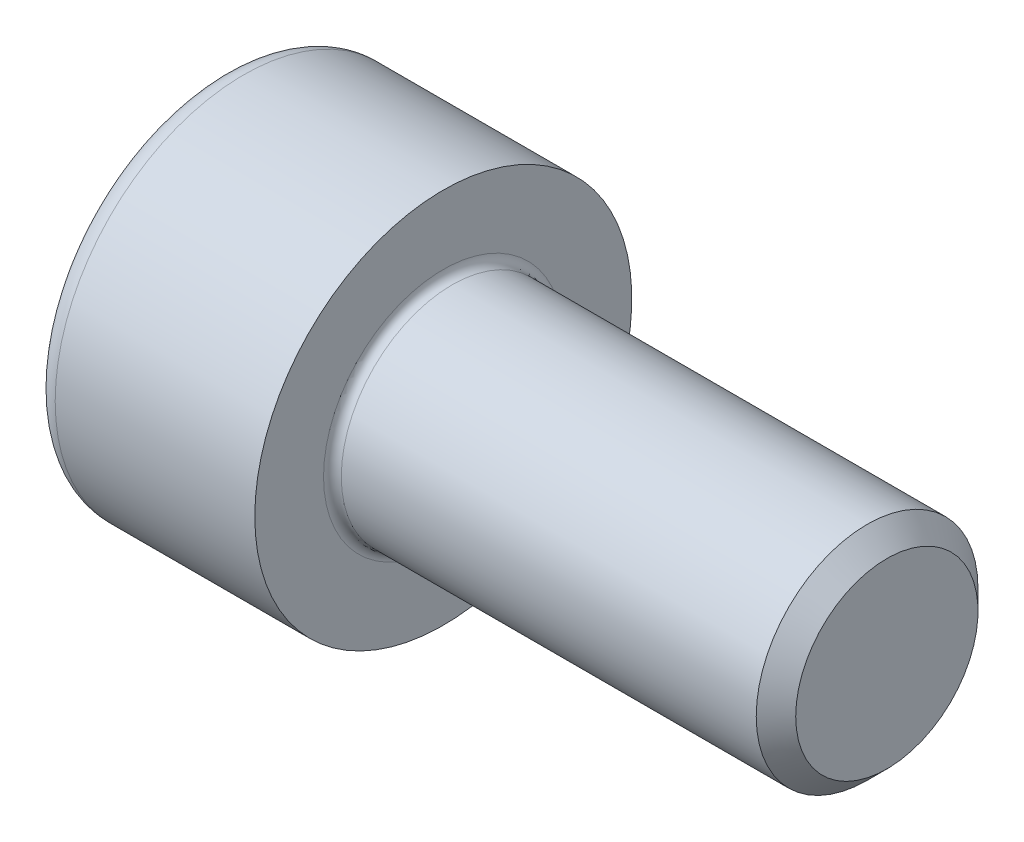
ISO-10303-21;
HEADER;
FILE_DESCRIPTION(('STEP AP214'),'2;1');
FILE_NAME('part.step','',(''),(''),'','','');
FILE_SCHEMA(('AUTOMOTIVE_DESIGN { 1 0 10303 214 1 1 1 1 }'));
ENDSEC;
DATA;
#1=APPLICATION_CONTEXT('core data for automotive mechanical design processes');
#2=APPLICATION_PROTOCOL_DEFINITION('international standard','automotive_design',2000,#1);
#3=PRODUCT_CONTEXT('',#1,'mechanical');
#4=PRODUCT('Part','Part','',(#3));
#5=PRODUCT_RELATED_PRODUCT_CATEGORY('part','',(#4));
#6=PRODUCT_DEFINITION_FORMATION('','',#4);
#7=PRODUCT_DEFINITION_CONTEXT('part definition',#1,'design');
#8=PRODUCT_DEFINITION('design','',#6,#7);
#9=PRODUCT_DEFINITION_SHAPE('','',#8);
#10=(LENGTH_UNIT() NAMED_UNIT(*) SI_UNIT(.MILLI.,.METRE.));
#11=(NAMED_UNIT(*) PLANE_ANGLE_UNIT() SI_UNIT($,.RADIAN.));
#12=(NAMED_UNIT(*) SI_UNIT($,.STERADIAN.) SOLID_ANGLE_UNIT());
#13=UNCERTAINTY_MEASURE_WITH_UNIT(LENGTH_MEASURE(1.E-05),#10,'distance_accuracy_value','');
#14=(GEOMETRIC_REPRESENTATION_CONTEXT(3) GLOBAL_UNCERTAINTY_ASSIGNED_CONTEXT((#13)) GLOBAL_UNIT_ASSIGNED_CONTEXT((#10,
#11,#12)) REPRESENTATION_CONTEXT('',''));
#15=CARTESIAN_POINT('',(0.,0.,0.));
#16=DIRECTION('',(0.,0.,1.));
#17=DIRECTION('',(1.,0.,0.));
#18=AXIS2_PLACEMENT_3D('',#15,#16,#17);
#19=CARTESIAN_POINT('',(0.,0.,0.));
#20=DIRECTION('',(-1.,0.,0.));
#21=DIRECTION('',(0.,0.,1.));
#22=AXIS2_PLACEMENT_3D('',#19,#20,#21);
#23=PLANE('',#22);
#24=DIRECTION('',(0.,-0.499999999999998,0.86602540378444));
#25=VECTOR('',#24,1.);
#26=CARTESIAN_POINT('',(0.,2.3209480821423,0.));
#27=LINE('',#26,#25);
#28=CARTESIAN_POINT('',(0.,2.3209480821423,0.));
#29=VERTEX_POINT('',#28);
#30=CARTESIAN_POINT('',(0.,1.16047404107115,2.01));
#31=VERTEX_POINT('',#30);
#32=EDGE_CURVE('E300',#29,#31,#27,.T.);
#33=ORIENTED_EDGE('',*,*,#32,.T.);
#34=DIRECTION('',(0.,1.,0.));
#35=VECTOR('',#34,1.);
#36=CARTESIAN_POINT('',(0.,-1.16047404107114,2.01));
#37=LINE('',#36,#35);
#38=CARTESIAN_POINT('',(0.,-1.16047404107114,2.01));
#39=VERTEX_POINT('',#38);
#40=EDGE_CURVE('E144',#39,#31,#37,.T.);
#41=ORIENTED_EDGE('',*,*,#40,.F.);
#42=DIRECTION('',(0.,-0.500000000000001,-0.866025403784438));
#43=VECTOR('',#42,1.);
#44=CARTESIAN_POINT('',(0.,-1.16047404107114,2.01));
#45=LINE('',#44,#43);
#46=CARTESIAN_POINT('',(0.,-2.3209480821423,0.));
#47=VERTEX_POINT('',#46);
#48=EDGE_CURVE('E305',#39,#47,#45,.T.);
#49=ORIENTED_EDGE('',*,*,#48,.T.);
#50=DIRECTION('',(0.,0.499999999999999,-0.86602540378444));
#51=VECTOR('',#50,1.);
#52=CARTESIAN_POINT('',(0.,-2.3209480821423,0.));
#53=LINE('',#52,#51);
#54=CARTESIAN_POINT('',(0.,-1.16047404107115,-2.01));
#55=VERTEX_POINT('',#54);
#56=EDGE_CURVE('E309',#47,#55,#53,.T.);
#57=ORIENTED_EDGE('',*,*,#56,.T.);
#58=DIRECTION('',(0.,-1.,0.));
#59=VECTOR('',#58,1.);
#60=CARTESIAN_POINT('',(0.,1.16047404107115,-2.01));
#61=LINE('',#60,#59);
#62=CARTESIAN_POINT('',(0.,1.16047404107115,-2.01));
#63=VERTEX_POINT('',#62);
#64=EDGE_CURVE('E313',#63,#55,#61,.T.);
#65=ORIENTED_EDGE('',*,*,#64,.F.);
#66=DIRECTION('',(0.,-0.500000000000001,-0.866025403784438));
#67=VECTOR('',#66,1.);
#68=CARTESIAN_POINT('',(0.,2.3209480821423,0.));
#69=LINE('',#68,#67);
#70=EDGE_CURVE('E139',#29,#63,#69,.T.);
#71=ORIENTED_EDGE('',*,*,#70,.F.);
#72=EDGE_LOOP('',(#33,#41,#49,#57,#65,#71));
#73=FACE_BOUND('',#72,.T.);
#74=CARTESIAN_POINT('',(0.,0.,0.));
#75=DIRECTION('',(-1.,0.,0.));
#76=DIRECTION('',(0.,0.,1.));
#77=AXIS2_PLACEMENT_3D('',#74,#75,#76);
#78=CIRCLE('',#77,3.75);
#79=CARTESIAN_POINT('',(0.,0.,3.75));
#80=VERTEX_POINT('',#79);
#81=EDGE_CURVE('E58',#80,#80,#78,.T.);
#82=ORIENTED_EDGE('',*,*,#81,.T.);
#83=EDGE_LOOP('',(#82));
#84=FACE_BOUND('',#83,.T.);
#85=ADVANCED_FACE('F49',(#73,#84),#23,.T.);
#86=CARTESIAN_POINT('',(-31.75,0.,0.));
#87=DIRECTION('',(-1.,0.,0.));
#88=DIRECTION('',(0.,0.,1.));
#89=AXIS2_PLACEMENT_3D('',#86,#87,#88);
#90=CYLINDRICAL_SURFACE('',#89,4.25);
#91=CARTESIAN_POINT('',(0.5,0.,0.));
#92=DIRECTION('',(-1.,0.,0.));
#93=DIRECTION('',(0.,0.,1.));
#94=AXIS2_PLACEMENT_3D('',#91,#92,#93);
#95=CIRCLE('',#94,4.25);
#96=CARTESIAN_POINT('',(0.5,0.,4.25));
#97=VERTEX_POINT('',#96);
#98=EDGE_CURVE('E11',#97,#97,#95,.F.);
#99=ORIENTED_EDGE('',*,*,#98,.T.);
#100=EDGE_LOOP('',(#99));
#101=FACE_BOUND('',#100,.T.);
#102=CARTESIAN_POINT('',(5.,0.,0.));
#103=DIRECTION('',(-1.,0.,0.));
#104=DIRECTION('',(0.,0.,1.));
#105=AXIS2_PLACEMENT_3D('',#102,#103,#104);
#106=CIRCLE('',#105,4.25);
#107=CARTESIAN_POINT('',(5.,0.,4.25));
#108=VERTEX_POINT('',#107);
#109=EDGE_CURVE('E168',#108,#108,#106,.T.);
#110=ORIENTED_EDGE('',*,*,#109,.T.);
#111=EDGE_LOOP('',(#110));
#112=FACE_BOUND('',#111,.T.);
#113=ADVANCED_FACE('F197',(#101,#112),#90,.T.);
#114=CARTESIAN_POINT('',(5.,4.25,0.));
#115=DIRECTION('',(1.,0.,0.));
#116=DIRECTION('',(0.,0.,-1.));
#117=AXIS2_PLACEMENT_3D('',#114,#115,#116);
#118=PLANE('',#117);
#119=CARTESIAN_POINT('',(5.,0.,0.));
#120=DIRECTION('',(1.,0.,0.));
#121=DIRECTION('',(0.,0.,-1.));
#122=AXIS2_PLACEMENT_3D('',#119,#120,#121);
#123=CIRCLE('',#122,2.7);
#124=CARTESIAN_POINT('',(5.,0.,-2.7));
#125=VERTEX_POINT('',#124);
#126=EDGE_CURVE('E172',#125,#125,#123,.F.);
#127=ORIENTED_EDGE('',*,*,#126,.T.);
#128=EDGE_LOOP('',(#127));
#129=FACE_BOUND('',#128,.T.);
#130=ORIENTED_EDGE('',*,*,#109,.F.);
#131=EDGE_LOOP('',(#130));
#132=FACE_BOUND('',#131,.T.);
#133=ADVANCED_FACE('F202',(#129,#132),#118,.T.);
#134=CARTESIAN_POINT('',(-31.75,0.,0.));
#135=DIRECTION('',(-1.,0.,0.));
#136=DIRECTION('',(0.,0.,1.));
#137=AXIS2_PLACEMENT_3D('',#134,#135,#136);
#138=CYLINDRICAL_SURFACE('',#137,2.5);
#139=CARTESIAN_POINT('',(5.2,0.,0.));
#140=DIRECTION('',(1.,0.,0.));
#141=DIRECTION('',(0.,0.,-1.));
#142=AXIS2_PLACEMENT_3D('',#139,#140,#141);
#143=CIRCLE('',#142,2.5);
#144=CARTESIAN_POINT('',(5.2,0.,-2.5));
#145=VERTEX_POINT('',#144);
#146=EDGE_CURVE('E176',#145,#145,#143,.T.);
#147=ORIENTED_EDGE('',*,*,#146,.T.);
#148=EDGE_LOOP('',(#147));
#149=FACE_BOUND('',#148,.T.);
#150=CARTESIAN_POINT('',(14.555,0.,0.));
#151=DIRECTION('',(-1.,0.,0.));
#152=DIRECTION('',(0.,0.,1.));
#153=AXIS2_PLACEMENT_3D('',#150,#151,#152);
#154=CIRCLE('',#153,2.5);
#155=CARTESIAN_POINT('',(14.555,0.,2.5));
#156=VERTEX_POINT('',#155);
#157=EDGE_CURVE('E164',#156,#156,#154,.T.);
#158=ORIENTED_EDGE('',*,*,#157,.T.);
#159=EDGE_LOOP('',(#158));
#160=FACE_BOUND('',#159,.T.);
#161=ADVANCED_FACE('F208',(#149,#160),#138,.T.);
#162=CARTESIAN_POINT('',(15.,0.,0.));
#163=DIRECTION('',(-1.,0.,0.));
#164=DIRECTION('',(0.,0.,1.));
#165=AXIS2_PLACEMENT_3D('',#162,#163,#164);
#166=CONICAL_SURFACE('',#165,2.055,0.785398163397455);
#167=ORIENTED_EDGE('',*,*,#157,.F.);
#168=EDGE_LOOP('',(#167));
#169=FACE_BOUND('',#168,.T.);
#170=CARTESIAN_POINT('',(15.,0.,0.));
#171=DIRECTION('',(-1.,0.,0.));
#172=DIRECTION('',(0.,0.,1.));
#173=AXIS2_PLACEMENT_3D('',#170,#171,#172);
#174=CIRCLE('',#173,2.055);
#175=CARTESIAN_POINT('',(15.,0.,2.055));
#176=VERTEX_POINT('',#175);
#177=EDGE_CURVE('E159',#176,#176,#174,.T.);
#178=ORIENTED_EDGE('',*,*,#177,.T.);
#179=EDGE_LOOP('',(#178));
#180=FACE_BOUND('',#179,.T.);
#181=ADVANCED_FACE('F212',(#169,#180),#166,.T.);
#182=CARTESIAN_POINT('',(15.,2.055,0.));
#183=DIRECTION('',(1.,0.,0.));
#184=DIRECTION('',(0.,0.,-1.));
#185=AXIS2_PLACEMENT_3D('',#182,#183,#184);
#186=PLANE('',#185);
#187=ORIENTED_EDGE('',*,*,#177,.F.);
#188=EDGE_LOOP('',(#187));
#189=FACE_BOUND('',#188,.T.);
#190=ADVANCED_FACE('F194',(#189),#186,.T.);
#191=CARTESIAN_POINT('',(5.2,0.,0.));
#192=DIRECTION('',(1.,0.,0.));
#193=DIRECTION('',(0.,0.,-1.));
#194=AXIS2_PLACEMENT_3D('',#191,#192,#193);
#195=TOROIDAL_SURFACE('',#194,2.7,0.2);
#196=ORIENTED_EDGE('',*,*,#146,.F.);
#197=EDGE_LOOP('',(#196));
#198=FACE_BOUND('',#197,.T.);
#199=ORIENTED_EDGE('',*,*,#126,.F.);
#200=EDGE_LOOP('',(#199));
#201=FACE_BOUND('',#200,.T.);
#202=ADVANCED_FACE('F185',(#198,#201),#195,.F.);
#203=CARTESIAN_POINT('',(0.5,0.,0.));
#204=DIRECTION('',(-1.,0.,0.));
#205=DIRECTION('',(0.,0.,1.));
#206=AXIS2_PLACEMENT_3D('',#203,#204,#205);
#207=TOROIDAL_SURFACE('',#206,3.75,0.5);
#208=ORIENTED_EDGE('',*,*,#98,.F.);
#209=EDGE_LOOP('',(#208));
#210=FACE_BOUND('',#209,.T.);
#211=ORIENTED_EDGE('',*,*,#81,.F.);
#212=EDGE_LOOP('',(#211));
#213=FACE_BOUND('',#212,.T.);
#214=ADVANCED_FACE('F51',(#210,#213),#207,.T.);
#215=CARTESIAN_POINT('',(2.5,2.3209480821423,0.));
#216=DIRECTION('',(0.,-0.86602540378444,-0.499999999999998));
#217=DIRECTION('',(0.,0.499999999999998,-0.86602540378444));
#218=AXIS2_PLACEMENT_3D('',#215,#216,#217);
#219=PLANE('',#218);
#220=ORIENTED_EDGE('',*,*,#32,.F.);
#221=DIRECTION('',(-1.,0.,0.));
#222=VECTOR('',#221,1.);
#223=CARTESIAN_POINT('',(2.5,2.3209480821423,0.));
#224=LINE('',#223,#222);
#225=CARTESIAN_POINT('',(2.5,2.3209480821423,0.));
#226=VERTEX_POINT('',#225);
#227=EDGE_CURVE('E299',#226,#29,#224,.T.);
#228=ORIENTED_EDGE('',*,*,#227,.F.);
#229=DIRECTION('',(0.,-0.499999999999998,0.86602540378444));
#230=VECTOR('',#229,1.);
#231=CARTESIAN_POINT('',(2.5,2.3209480821423,0.));
#232=LINE('',#231,#230);
#233=CARTESIAN_POINT('',(2.5,1.74071106160672,1.005));
#234=VERTEX_POINT('',#233);
#235=EDGE_CURVE('E65',#226,#234,#232,.T.);
#236=ORIENTED_EDGE('',*,*,#235,.T.);
#237=CARTESIAN_POINT('',(2.5,1.16047404107115,2.01));
#238=VERTEX_POINT('',#237);
#239=EDGE_CURVE('E123',#234,#238,#232,.T.);
#240=ORIENTED_EDGE('',*,*,#239,.T.);
#241=DIRECTION('',(-1.,0.,0.));
#242=VECTOR('',#241,1.);
#243=CARTESIAN_POINT('',(2.5,1.16047404107115,2.01));
#244=LINE('',#243,#242);
#245=EDGE_CURVE('E136',#238,#31,#244,.T.);
#246=ORIENTED_EDGE('',*,*,#245,.T.);
#247=EDGE_LOOP('',(#220,#228,#236,#240,#246));
#248=FACE_BOUND('',#247,.T.);
#249=ADVANCED_FACE('F135',(#248),#219,.T.);
#250=CARTESIAN_POINT('',(2.5,-1.16047404107114,2.01));
#251=DIRECTION('',(0.,0.,1.));
#252=DIRECTION('',(0.,-1.,0.));
#253=AXIS2_PLACEMENT_3D('',#250,#251,#252);
#254=PLANE('',#253);
#255=ORIENTED_EDGE('',*,*,#40,.T.);
#256=ORIENTED_EDGE('',*,*,#245,.F.);
#257=DIRECTION('',(0.,1.,0.));
#258=VECTOR('',#257,1.);
#259=CARTESIAN_POINT('',(2.5,-1.16047404107114,2.01));
#260=LINE('',#259,#258);
#261=CARTESIAN_POINT('',(2.5,0.,2.01));
#262=VERTEX_POINT('',#261);
#263=EDGE_CURVE('E121',#262,#238,#260,.T.);
#264=ORIENTED_EDGE('',*,*,#263,.F.);
#265=CARTESIAN_POINT('',(2.5,-1.16047404107114,2.01));
#266=VERTEX_POINT('',#265);
#267=EDGE_CURVE('E132',#266,#262,#260,.T.);
#268=ORIENTED_EDGE('',*,*,#267,.F.);
#269=DIRECTION('',(-1.,0.,0.));
#270=VECTOR('',#269,1.);
#271=CARTESIAN_POINT('',(2.5,-1.16047404107114,2.01));
#272=LINE('',#271,#270);
#273=EDGE_CURVE('E147',#266,#39,#272,.T.);
#274=ORIENTED_EDGE('',*,*,#273,.T.);
#275=EDGE_LOOP('',(#255,#256,#264,#268,#274));
#276=FACE_BOUND('',#275,.T.);
#277=ADVANCED_FACE('F141',(#276),#254,.F.);
#278=CARTESIAN_POINT('',(2.5,-1.16047404107114,2.01));
#279=DIRECTION('',(0.,0.866025403784438,-0.500000000000001));
#280=DIRECTION('',(0.,0.500000000000001,0.866025403784438));
#281=AXIS2_PLACEMENT_3D('',#278,#279,#280);
#282=PLANE('',#281);
#283=ORIENTED_EDGE('',*,*,#48,.F.);
#284=ORIENTED_EDGE('',*,*,#273,.F.);
#285=DIRECTION('',(0.,-0.500000000000001,-0.866025403784438));
#286=VECTOR('',#285,1.);
#287=CARTESIAN_POINT('',(2.5,-1.16047404107114,2.01));
#288=LINE('',#287,#286);
#289=CARTESIAN_POINT('',(2.5,-1.74071106160672,1.005));
#290=VERTEX_POINT('',#289);
#291=EDGE_CURVE('E274',#266,#290,#288,.T.);
#292=ORIENTED_EDGE('',*,*,#291,.T.);
#293=CARTESIAN_POINT('',(2.5,-2.3209480821423,0.));
#294=VERTEX_POINT('',#293);
#295=EDGE_CURVE('E276',#290,#294,#288,.T.);
#296=ORIENTED_EDGE('',*,*,#295,.T.);
#297=DIRECTION('',(-1.,0.,0.));
#298=VECTOR('',#297,1.);
#299=CARTESIAN_POINT('',(2.5,-2.3209480821423,0.));
#300=LINE('',#299,#298);
#301=EDGE_CURVE('E154',#294,#47,#300,.T.);
#302=ORIENTED_EDGE('',*,*,#301,.T.);
#303=EDGE_LOOP('',(#283,#284,#292,#296,#302));
#304=FACE_BOUND('',#303,.T.);
#305=ADVANCED_FACE('F225',(#304),#282,.T.);
#306=CARTESIAN_POINT('',(2.5,-2.3209480821423,0.));
#307=DIRECTION('',(0.,0.86602540378444,0.499999999999998));
#308=DIRECTION('',(0.,-0.499999999999998,0.86602540378444));
#309=AXIS2_PLACEMENT_3D('',#306,#307,#308);
#310=PLANE('',#309);
#311=ORIENTED_EDGE('',*,*,#56,.F.);
#312=ORIENTED_EDGE('',*,*,#301,.F.);
#313=DIRECTION('',(0.,0.499999999999999,-0.86602540378444));
#314=VECTOR('',#313,1.);
#315=CARTESIAN_POINT('',(2.5,-2.3209480821423,0.));
#316=LINE('',#315,#314);
#317=CARTESIAN_POINT('',(2.5,-1.74071106160672,-1.005));
#318=VERTEX_POINT('',#317);
#319=EDGE_CURVE('E279',#294,#318,#316,.T.);
#320=ORIENTED_EDGE('',*,*,#319,.T.);
#321=CARTESIAN_POINT('',(2.5,-1.16047404107115,-2.01));
#322=VERTEX_POINT('',#321);
#323=EDGE_CURVE('E285',#318,#322,#316,.T.);
#324=ORIENTED_EDGE('',*,*,#323,.T.);
#325=DIRECTION('',(-1.,0.,0.));
#326=VECTOR('',#325,1.);
#327=CARTESIAN_POINT('',(2.5,-1.16047404107115,-2.01));
#328=LINE('',#327,#326);
#329=EDGE_CURVE('E326',#322,#55,#328,.T.);
#330=ORIENTED_EDGE('',*,*,#329,.T.);
#331=EDGE_LOOP('',(#311,#312,#320,#324,#330));
#332=FACE_BOUND('',#331,.T.);
#333=ADVANCED_FACE('F228',(#332),#310,.T.);
#334=CARTESIAN_POINT('',(2.5,1.16047404107115,-2.01));
#335=DIRECTION('',(0.,0.,-1.));
#336=DIRECTION('',(0.,1.,0.));
#337=AXIS2_PLACEMENT_3D('',#334,#335,#336);
#338=PLANE('',#337);
#339=ORIENTED_EDGE('',*,*,#64,.T.);
#340=ORIENTED_EDGE('',*,*,#329,.F.);
#341=DIRECTION('',(0.,-1.,0.));
#342=VECTOR('',#341,1.);
#343=CARTESIAN_POINT('',(2.5,1.16047404107115,-2.01));
#344=LINE('',#343,#342);
#345=CARTESIAN_POINT('',(2.5,0.,-2.01));
#346=VERTEX_POINT('',#345);
#347=EDGE_CURVE('E291',#346,#322,#344,.T.);
#348=ORIENTED_EDGE('',*,*,#347,.F.);
#349=CARTESIAN_POINT('',(2.5,1.16047404107115,-2.01));
#350=VERTEX_POINT('',#349);
#351=EDGE_CURVE('E292',#350,#346,#344,.T.);
#352=ORIENTED_EDGE('',*,*,#351,.F.);
#353=DIRECTION('',(-1.,0.,0.));
#354=VECTOR('',#353,1.);
#355=CARTESIAN_POINT('',(2.5,1.16047404107115,-2.01));
#356=LINE('',#355,#354);
#357=EDGE_CURVE('E322',#350,#63,#356,.T.);
#358=ORIENTED_EDGE('',*,*,#357,.T.);
#359=EDGE_LOOP('',(#339,#340,#348,#352,#358));
#360=FACE_BOUND('',#359,.T.);
#361=ADVANCED_FACE('F232',(#360),#338,.F.);
#362=CARTESIAN_POINT('',(2.5,2.3209480821423,0.));
#363=DIRECTION('',(0.,0.866025403784438,-0.500000000000001));
#364=DIRECTION('',(0.,0.500000000000001,0.866025403784438));
#365=AXIS2_PLACEMENT_3D('',#362,#363,#364);
#366=PLANE('',#365);
#367=ORIENTED_EDGE('',*,*,#70,.T.);
#368=ORIENTED_EDGE('',*,*,#357,.F.);
#369=DIRECTION('',(0.,-0.500000000000001,-0.866025403784438));
#370=VECTOR('',#369,1.);
#371=CARTESIAN_POINT('',(2.5,2.3209480821423,0.));
#372=LINE('',#371,#370);
#373=CARTESIAN_POINT('',(2.5,1.74071106160672,-1.005));
#374=VERTEX_POINT('',#373);
#375=EDGE_CURVE('E296',#374,#350,#372,.T.);
#376=ORIENTED_EDGE('',*,*,#375,.F.);
#377=EDGE_CURVE('E264',#226,#374,#372,.T.);
#378=ORIENTED_EDGE('',*,*,#377,.F.);
#379=ORIENTED_EDGE('',*,*,#227,.T.);
#380=EDGE_LOOP('',(#367,#368,#376,#378,#379));
#381=FACE_BOUND('',#380,.T.);
#382=ADVANCED_FACE('F236',(#381),#366,.F.);
#383=CARTESIAN_POINT('',(2.5,1.16047404107115,2.01));
#384=DIRECTION('',(-1.,0.,0.));
#385=DIRECTION('',(0.,0.,1.));
#386=AXIS2_PLACEMENT_3D('',#383,#384,#385);
#387=PLANE('',#386);
#388=CARTESIAN_POINT('',(2.5,0.,0.));
#389=DIRECTION('',(-1.,0.,0.));
#390=DIRECTION('',(0.,0.,1.));
#391=AXIS2_PLACEMENT_3D('',#388,#389,#390);
#392=CIRCLE('',#391,2.01);
#393=EDGE_CURVE('E146',#290,#262,#392,.T.);
#394=ORIENTED_EDGE('',*,*,#393,.F.);
#395=ORIENTED_EDGE('',*,*,#291,.F.);
#396=ORIENTED_EDGE('',*,*,#267,.T.);
#397=EDGE_LOOP('',(#394,#395,#396));
#398=FACE_BOUND('',#397,.T.);
#399=ADVANCED_FACE('F240',(#398),#387,.T.);
#400=EDGE_CURVE('E152',#318,#290,#392,.T.);
#401=ORIENTED_EDGE('',*,*,#400,.F.);
#402=ORIENTED_EDGE('',*,*,#319,.F.);
#403=ORIENTED_EDGE('',*,*,#295,.F.);
#404=EDGE_LOOP('',(#401,#402,#403));
#405=FACE_BOUND('',#404,.T.);
#406=ADVANCED_FACE('F243',(#405),#387,.T.);
#407=EDGE_CURVE('E338',#346,#318,#392,.T.);
#408=ORIENTED_EDGE('',*,*,#407,.F.);
#409=ORIENTED_EDGE('',*,*,#347,.T.);
#410=ORIENTED_EDGE('',*,*,#323,.F.);
#411=EDGE_LOOP('',(#408,#409,#410));
#412=FACE_BOUND('',#411,.T.);
#413=ADVANCED_FACE('F248',(#412),#387,.T.);
#414=EDGE_CURVE('E268',#374,#346,#392,.T.);
#415=ORIENTED_EDGE('',*,*,#414,.F.);
#416=ORIENTED_EDGE('',*,*,#375,.T.);
#417=ORIENTED_EDGE('',*,*,#351,.T.);
#418=EDGE_LOOP('',(#415,#416,#417));
#419=FACE_BOUND('',#418,.T.);
#420=ADVANCED_FACE('F255',(#419),#387,.T.);
#421=EDGE_CURVE('E160',#234,#374,#392,.T.);
#422=ORIENTED_EDGE('',*,*,#421,.F.);
#423=ORIENTED_EDGE('',*,*,#235,.F.);
#424=ORIENTED_EDGE('',*,*,#377,.T.);
#425=EDGE_LOOP('',(#422,#423,#424));
#426=FACE_BOUND('',#425,.T.);
#427=ADVANCED_FACE('F251',(#426),#387,.T.);
#428=EDGE_CURVE('E126',#262,#234,#392,.T.);
#429=ORIENTED_EDGE('',*,*,#428,.F.);
#430=ORIENTED_EDGE('',*,*,#263,.T.);
#431=ORIENTED_EDGE('',*,*,#239,.F.);
#432=EDGE_LOOP('',(#429,#430,#431));
#433=FACE_BOUND('',#432,.T.);
#434=ADVANCED_FACE('F122',(#433),#387,.T.);
#435=CARTESIAN_POINT('',(2.5,0.,0.));
#436=DIRECTION('',(-1.,0.,0.));
#437=DIRECTION('',(0.,0.,1.));
#438=AXIS2_PLACEMENT_3D('',#435,#436,#437);
#439=CONICAL_SURFACE('',#438,2.01,1.04719755119659);
#440=CARTESIAN_POINT('',(3.66047404107116,0.,0.));
#441=VERTEX_POINT('',#440);
#442=VERTEX_LOOP('',#441);
#443=FACE_BOUND('',#442,.T.);
#444=ORIENTED_EDGE('',*,*,#428,.T.);
#445=ORIENTED_EDGE('',*,*,#421,.T.);
#446=ORIENTED_EDGE('',*,*,#414,.T.);
#447=ORIENTED_EDGE('',*,*,#407,.T.);
#448=ORIENTED_EDGE('',*,*,#400,.T.);
#449=ORIENTED_EDGE('',*,*,#393,.T.);
#450=EDGE_LOOP('',(#444,#445,#446,#447,#448,#449));
#451=FACE_BOUND('',#450,.T.);
#452=ADVANCED_FACE('F220',(#443,#451),#439,.F.);
#453=CLOSED_SHELL('',(#85,#113,#133,#161,#181,#190,#202,#214,#249,#277,#305,#333,#361,#382,#399,
#406,#413,#420,#427,#434,#452));
#454=MANIFOLD_SOLID_BREP('B2',#453);
#455=ADVANCED_BREP_SHAPE_REPRESENTATION('',(#18,#454),#14);
#456=SHAPE_DEFINITION_REPRESENTATION(#9,#455);
ENDSEC;
END-ISO-10303-21;
